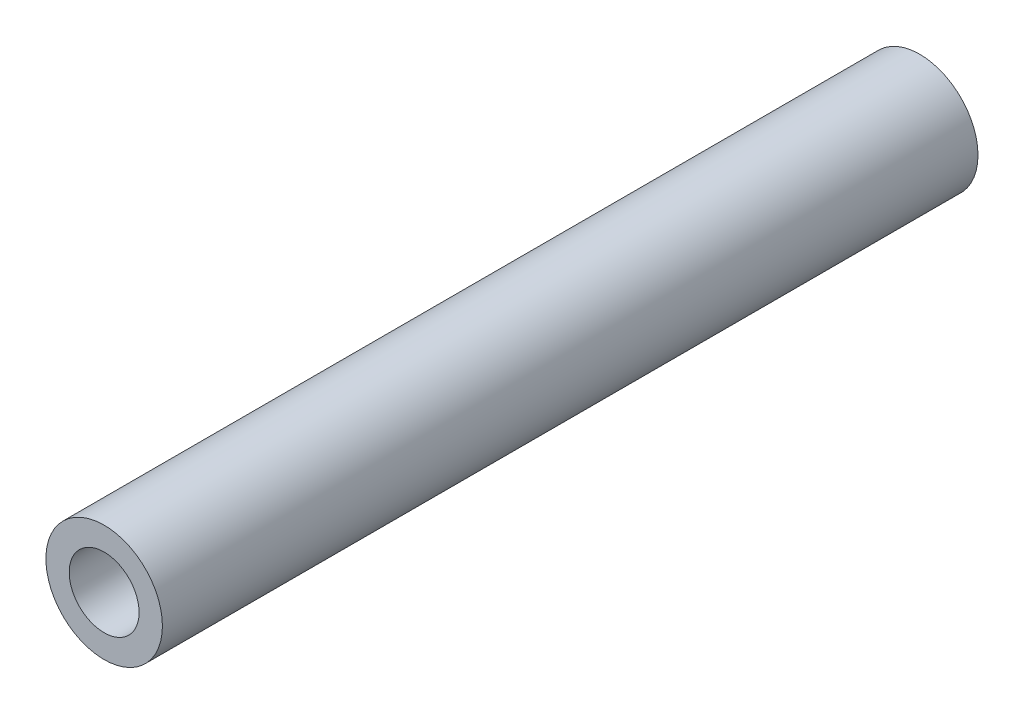
ISO-10303-21;
HEADER;
FILE_DESCRIPTION(('STEP AP214'),'2;1');
FILE_NAME('part.step','',(''),(''),'','','');
FILE_SCHEMA(('AUTOMOTIVE_DESIGN { 1 0 10303 214 1 1 1 1 }'));
ENDSEC;
DATA;
#1=APPLICATION_CONTEXT('core data for automotive mechanical design processes');
#2=APPLICATION_PROTOCOL_DEFINITION('international standard','automotive_design',2000,#1);
#3=PRODUCT_CONTEXT('',#1,'mechanical');
#4=PRODUCT('Part','Part','',(#3));
#5=PRODUCT_RELATED_PRODUCT_CATEGORY('part','',(#4));
#6=PRODUCT_DEFINITION_FORMATION('','',#4);
#7=PRODUCT_DEFINITION_CONTEXT('part definition',#1,'design');
#8=PRODUCT_DEFINITION('design','',#6,#7);
#9=PRODUCT_DEFINITION_SHAPE('','',#8);
#10=(LENGTH_UNIT() NAMED_UNIT(*) SI_UNIT(.MILLI.,.METRE.));
#11=(NAMED_UNIT(*) PLANE_ANGLE_UNIT() SI_UNIT($,.RADIAN.));
#12=(NAMED_UNIT(*) SI_UNIT($,.STERADIAN.) SOLID_ANGLE_UNIT());
#13=UNCERTAINTY_MEASURE_WITH_UNIT(LENGTH_MEASURE(1.E-05),#10,'distance_accuracy_value','');
#14=(GEOMETRIC_REPRESENTATION_CONTEXT(3) GLOBAL_UNCERTAINTY_ASSIGNED_CONTEXT((#13)) GLOBAL_UNIT_ASSIGNED_CONTEXT((#10,
#11,#12)) REPRESENTATION_CONTEXT('',''));
#15=CARTESIAN_POINT('',(0.,0.,0.));
#16=DIRECTION('',(0.,0.,1.));
#17=DIRECTION('',(1.,0.,0.));
#18=AXIS2_PLACEMENT_3D('',#15,#16,#17);
#19=CARTESIAN_POINT('',(0.,0.,35.));
#20=DIRECTION('',(0.,0.,1.));
#21=DIRECTION('',(1.,0.,0.));
#22=AXIS2_PLACEMENT_3D('',#19,#20,#21);
#23=PLANE('',#22);
#24=CARTESIAN_POINT('',(0.,0.,35.));
#25=DIRECTION('',(0.,0.,1.));
#26=DIRECTION('',(1.,0.,0.));
#27=AXIS2_PLACEMENT_3D('',#24,#25,#26);
#28=CIRCLE('',#27,2.5);
#29=CARTESIAN_POINT('',(2.5,0.,35.));
#30=VERTEX_POINT('',#29);
#31=EDGE_CURVE('E10',#30,#30,#28,.T.);
#32=ORIENTED_EDGE('',*,*,#31,.T.);
#33=EDGE_LOOP('',(#32));
#34=FACE_BOUND('',#33,.T.);
#35=CARTESIAN_POINT('',(0.,0.,35.));
#36=DIRECTION('',(0.,0.,1.));
#37=DIRECTION('',(1.,0.,0.));
#38=AXIS2_PLACEMENT_3D('',#35,#36,#37);
#39=CIRCLE('',#38,1.5);
#40=CARTESIAN_POINT('',(1.5,0.,35.));
#41=VERTEX_POINT('',#40);
#42=EDGE_CURVE('E43',#41,#41,#39,.T.);
#43=ORIENTED_EDGE('',*,*,#42,.F.);
#44=EDGE_LOOP('',(#43));
#45=FACE_BOUND('',#44,.T.);
#46=ADVANCED_FACE('F32',(#34,#45),#23,.T.);
#47=CARTESIAN_POINT('',(0.,0.,0.));
#48=DIRECTION('',(0.,0.,1.));
#49=DIRECTION('',(1.,0.,0.));
#50=AXIS2_PLACEMENT_3D('',#47,#48,#49);
#51=PLANE('',#50);
#52=CARTESIAN_POINT('',(0.,0.,0.));
#53=DIRECTION('',(0.,0.,1.));
#54=DIRECTION('',(1.,0.,0.));
#55=AXIS2_PLACEMENT_3D('',#52,#53,#54);
#56=CIRCLE('',#55,2.5);
#57=CARTESIAN_POINT('',(2.5,0.,0.));
#58=VERTEX_POINT('',#57);
#59=EDGE_CURVE('E36',#58,#58,#56,.T.);
#60=ORIENTED_EDGE('',*,*,#59,.F.);
#61=EDGE_LOOP('',(#60));
#62=FACE_BOUND('',#61,.T.);
#63=CARTESIAN_POINT('',(0.,0.,0.));
#64=DIRECTION('',(0.,0.,1.));
#65=DIRECTION('',(1.,0.,0.));
#66=AXIS2_PLACEMENT_3D('',#63,#64,#65);
#67=CIRCLE('',#66,1.5);
#68=CARTESIAN_POINT('',(1.5,0.,0.));
#69=VERTEX_POINT('',#68);
#70=EDGE_CURVE('E45',#69,#69,#67,.T.);
#71=ORIENTED_EDGE('',*,*,#70,.T.);
#72=EDGE_LOOP('',(#71));
#73=FACE_BOUND('',#72,.T.);
#74=ADVANCED_FACE('F55',(#62,#73),#51,.F.);
#75=CARTESIAN_POINT('',(0.,0.,35.));
#76=DIRECTION('',(0.,0.,-1.));
#77=DIRECTION('',(-1.,0.,0.));
#78=AXIS2_PLACEMENT_3D('',#75,#76,#77);
#79=CYLINDRICAL_SURFACE('',#78,2.5);
#80=ORIENTED_EDGE('',*,*,#31,.F.);
#81=EDGE_LOOP('',(#80));
#82=FACE_BOUND('',#81,.T.);
#83=ORIENTED_EDGE('',*,*,#59,.T.);
#84=EDGE_LOOP('',(#83));
#85=FACE_BOUND('',#84,.T.);
#86=ADVANCED_FACE('F34',(#82,#85),#79,.T.);
#87=CARTESIAN_POINT('',(0.,0.,35.));
#88=DIRECTION('',(0.,0.,-1.));
#89=DIRECTION('',(-1.,0.,0.));
#90=AXIS2_PLACEMENT_3D('',#87,#88,#89);
#91=CYLINDRICAL_SURFACE('',#90,1.5);
#92=ORIENTED_EDGE('',*,*,#42,.T.);
#93=EDGE_LOOP('',(#92));
#94=FACE_BOUND('',#93,.T.);
#95=ORIENTED_EDGE('',*,*,#70,.F.);
#96=EDGE_LOOP('',(#95));
#97=FACE_BOUND('',#96,.T.);
#98=ADVANCED_FACE('F51',(#94,#97),#91,.F.);
#99=CLOSED_SHELL('',(#46,#74,#86,#98));
#100=MANIFOLD_SOLID_BREP('B2',#99);
#101=ADVANCED_BREP_SHAPE_REPRESENTATION('',(#18,#100),#14);
#102=SHAPE_DEFINITION_REPRESENTATION(#9,#101);
ENDSEC;
END-ISO-10303-21;
